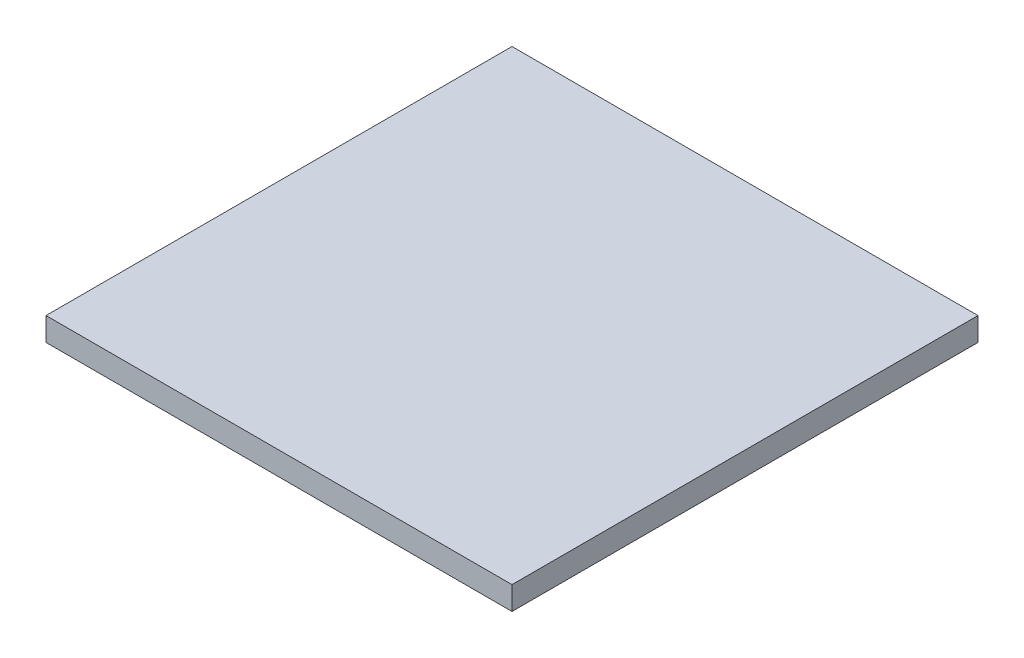
ISO-10303-21;
HEADER;
FILE_DESCRIPTION(('STEP AP214'),'2;1');
FILE_NAME('part.step','',(''),(''),'','','');
FILE_SCHEMA(('AUTOMOTIVE_DESIGN { 1 0 10303 214 1 1 1 1 }'));
ENDSEC;
DATA;
#1=APPLICATION_CONTEXT('core data for automotive mechanical design processes');
#2=APPLICATION_PROTOCOL_DEFINITION('international standard','automotive_design',2000,#1);
#3=PRODUCT_CONTEXT('',#1,'mechanical');
#4=PRODUCT('Part','Part','',(#3));
#5=PRODUCT_RELATED_PRODUCT_CATEGORY('part','',(#4));
#6=PRODUCT_DEFINITION_FORMATION('','',#4);
#7=PRODUCT_DEFINITION_CONTEXT('part definition',#1,'design');
#8=PRODUCT_DEFINITION('design','',#6,#7);
#9=PRODUCT_DEFINITION_SHAPE('','',#8);
#10=(LENGTH_UNIT() NAMED_UNIT(*) SI_UNIT(.MILLI.,.METRE.));
#11=(NAMED_UNIT(*) PLANE_ANGLE_UNIT() SI_UNIT($,.RADIAN.));
#12=(NAMED_UNIT(*) SI_UNIT($,.STERADIAN.) SOLID_ANGLE_UNIT());
#13=UNCERTAINTY_MEASURE_WITH_UNIT(LENGTH_MEASURE(1.E-05),#10,'distance_accuracy_value','');
#14=(GEOMETRIC_REPRESENTATION_CONTEXT(3) GLOBAL_UNCERTAINTY_ASSIGNED_CONTEXT((#13)) GLOBAL_UNIT_ASSIGNED_CONTEXT((#10,
#11,#12)) REPRESENTATION_CONTEXT('',''));
#15=CARTESIAN_POINT('',(0.,0.,0.));
#16=DIRECTION('',(0.,0.,1.));
#17=DIRECTION('',(1.,0.,0.));
#18=AXIS2_PLACEMENT_3D('',#15,#16,#17);
#19=CARTESIAN_POINT('',(0.,5.,0.));
#20=DIRECTION('',(1.,0.,0.));
#21=DIRECTION('',(0.,0.,-1.));
#22=AXIS2_PLACEMENT_3D('',#19,#20,#21);
#23=PLANE('',#22);
#24=DIRECTION('',(0.,0.,1.));
#25=VECTOR('',#24,1.);
#26=CARTESIAN_POINT('',(0.,0.,0.));
#27=LINE('',#26,#25);
#28=CARTESIAN_POINT('',(0.,0.,-100.));
#29=VERTEX_POINT('',#28);
#30=CARTESIAN_POINT('',(0.,0.,0.));
#31=VERTEX_POINT('',#30);
#32=EDGE_CURVE('E113',#29,#31,#27,.T.);
#33=ORIENTED_EDGE('',*,*,#32,.T.);
#34=DIRECTION('',(0.,-1.,0.));
#35=VECTOR('',#34,1.);
#36=CARTESIAN_POINT('',(0.,5.,0.));
#37=LINE('',#36,#35);
#38=CARTESIAN_POINT('',(0.,5.,0.));
#39=VERTEX_POINT('',#38);
#40=EDGE_CURVE('E11',#39,#31,#37,.T.);
#41=ORIENTED_EDGE('',*,*,#40,.F.);
#42=DIRECTION('',(0.,0.,1.));
#43=VECTOR('',#42,1.);
#44=CARTESIAN_POINT('',(0.,5.,0.));
#45=LINE('',#44,#43);
#46=CARTESIAN_POINT('',(0.,5.,-100.));
#47=VERTEX_POINT('',#46);
#48=EDGE_CURVE('E97',#47,#39,#45,.T.);
#49=ORIENTED_EDGE('',*,*,#48,.F.);
#50=DIRECTION('',(0.,-1.,0.));
#51=VECTOR('',#50,1.);
#52=CARTESIAN_POINT('',(0.,5.,-100.));
#53=LINE('',#52,#51);
#54=EDGE_CURVE('E109',#47,#29,#53,.T.);
#55=ORIENTED_EDGE('',*,*,#54,.T.);
#56=EDGE_LOOP('',(#33,#41,#49,#55));
#57=FACE_BOUND('',#56,.T.);
#58=ADVANCED_FACE('F45',(#57),#23,.F.);
#59=CARTESIAN_POINT('',(0.,5.,0.));
#60=DIRECTION('',(0.,0.,-1.));
#61=DIRECTION('',(-1.,0.,0.));
#62=AXIS2_PLACEMENT_3D('',#59,#60,#61);
#63=PLANE('',#62);
#64=DIRECTION('',(1.,0.,0.));
#65=VECTOR('',#64,1.);
#66=CARTESIAN_POINT('',(0.,0.,0.));
#67=LINE('',#66,#65);
#68=CARTESIAN_POINT('',(100.,0.,0.));
#69=VERTEX_POINT('',#68);
#70=EDGE_CURVE('E102',#31,#69,#67,.T.);
#71=ORIENTED_EDGE('',*,*,#70,.T.);
#72=DIRECTION('',(0.,-1.,0.));
#73=VECTOR('',#72,1.);
#74=CARTESIAN_POINT('',(100.,5.,0.));
#75=LINE('',#74,#73);
#76=CARTESIAN_POINT('',(100.,5.,0.));
#77=VERTEX_POINT('',#76);
#78=EDGE_CURVE('E54',#77,#69,#75,.T.);
#79=ORIENTED_EDGE('',*,*,#78,.F.);
#80=DIRECTION('',(1.,0.,0.));
#81=VECTOR('',#80,1.);
#82=CARTESIAN_POINT('',(0.,5.,0.));
#83=LINE('',#82,#81);
#84=EDGE_CURVE('E92',#39,#77,#83,.T.);
#85=ORIENTED_EDGE('',*,*,#84,.F.);
#86=ORIENTED_EDGE('',*,*,#40,.T.);
#87=EDGE_LOOP('',(#71,#79,#85,#86));
#88=FACE_BOUND('',#87,.T.);
#89=ADVANCED_FACE('F101',(#88),#63,.F.);
#90=CARTESIAN_POINT('',(100.,5.,0.));
#91=DIRECTION('',(-1.,0.,0.));
#92=DIRECTION('',(0.,0.,1.));
#93=AXIS2_PLACEMENT_3D('',#90,#91,#92);
#94=PLANE('',#93);
#95=DIRECTION('',(0.,0.,-1.));
#96=VECTOR('',#95,1.);
#97=CARTESIAN_POINT('',(100.,0.,0.));
#98=LINE('',#97,#96);
#99=CARTESIAN_POINT('',(100.,0.,-100.));
#100=VERTEX_POINT('',#99);
#101=EDGE_CURVE('E79',#69,#100,#98,.T.);
#102=ORIENTED_EDGE('',*,*,#101,.T.);
#103=DIRECTION('',(0.,-1.,0.));
#104=VECTOR('',#103,1.);
#105=CARTESIAN_POINT('',(100.,5.,-100.));
#106=LINE('',#105,#104);
#107=CARTESIAN_POINT('',(100.,5.,-100.));
#108=VERTEX_POINT('',#107);
#109=EDGE_CURVE('E104',#108,#100,#106,.T.);
#110=ORIENTED_EDGE('',*,*,#109,.F.);
#111=DIRECTION('',(0.,0.,-1.));
#112=VECTOR('',#111,1.);
#113=CARTESIAN_POINT('',(100.,5.,0.));
#114=LINE('',#113,#112);
#115=EDGE_CURVE('E95',#77,#108,#114,.T.);
#116=ORIENTED_EDGE('',*,*,#115,.F.);
#117=ORIENTED_EDGE('',*,*,#78,.T.);
#118=EDGE_LOOP('',(#102,#110,#116,#117));
#119=FACE_BOUND('',#118,.T.);
#120=ADVANCED_FACE('F105',(#119),#94,.F.);
#121=CARTESIAN_POINT('',(0.,5.,-100.));
#122=DIRECTION('',(0.,0.,1.));
#123=DIRECTION('',(1.,0.,0.));
#124=AXIS2_PLACEMENT_3D('',#121,#122,#123);
#125=PLANE('',#124);
#126=DIRECTION('',(-1.,0.,0.));
#127=VECTOR('',#126,1.);
#128=CARTESIAN_POINT('',(0.,0.,-100.));
#129=LINE('',#128,#127);
#130=EDGE_CURVE('E85',#100,#29,#129,.T.);
#131=ORIENTED_EDGE('',*,*,#130,.T.);
#132=ORIENTED_EDGE('',*,*,#54,.F.);
#133=DIRECTION('',(-1.,0.,0.));
#134=VECTOR('',#133,1.);
#135=CARTESIAN_POINT('',(0.,5.,-100.));
#136=LINE('',#135,#134);
#137=EDGE_CURVE('E62',#108,#47,#136,.T.);
#138=ORIENTED_EDGE('',*,*,#137,.F.);
#139=ORIENTED_EDGE('',*,*,#109,.T.);
#140=EDGE_LOOP('',(#131,#132,#138,#139));
#141=FACE_BOUND('',#140,.T.);
#142=ADVANCED_FACE('F126',(#141),#125,.F.);
#143=CARTESIAN_POINT('',(0.,5.,0.));
#144=DIRECTION('',(0.,-1.,0.));
#145=DIRECTION('',(0.,0.,-1.));
#146=AXIS2_PLACEMENT_3D('',#143,#144,#145);
#147=PLANE('',#146);
#148=ORIENTED_EDGE('',*,*,#48,.T.);
#149=ORIENTED_EDGE('',*,*,#84,.T.);
#150=ORIENTED_EDGE('',*,*,#115,.T.);
#151=ORIENTED_EDGE('',*,*,#137,.T.);
#152=EDGE_LOOP('',(#148,#149,#150,#151));
#153=FACE_BOUND('',#152,.T.);
#154=ADVANCED_FACE('F93',(#153),#147,.F.);
#155=CARTESIAN_POINT('',(0.,0.,0.));
#156=DIRECTION('',(0.,-1.,0.));
#157=DIRECTION('',(0.,0.,-1.));
#158=AXIS2_PLACEMENT_3D('',#155,#156,#157);
#159=PLANE('',#158);
#160=ORIENTED_EDGE('',*,*,#32,.F.);
#161=ORIENTED_EDGE('',*,*,#130,.F.);
#162=ORIENTED_EDGE('',*,*,#101,.F.);
#163=ORIENTED_EDGE('',*,*,#70,.F.);
#164=EDGE_LOOP('',(#160,#161,#162,#163));
#165=FACE_BOUND('',#164,.T.);
#166=ADVANCED_FACE('F129',(#165),#159,.T.);
#167=CLOSED_SHELL('',(#58,#89,#120,#142,#154,#166));
#168=MANIFOLD_SOLID_BREP('B2',#167);
#169=ADVANCED_BREP_SHAPE_REPRESENTATION('',(#18,#168),#14);
#170=SHAPE_DEFINITION_REPRESENTATION(#9,#169);
ENDSEC;
END-ISO-10303-21;
